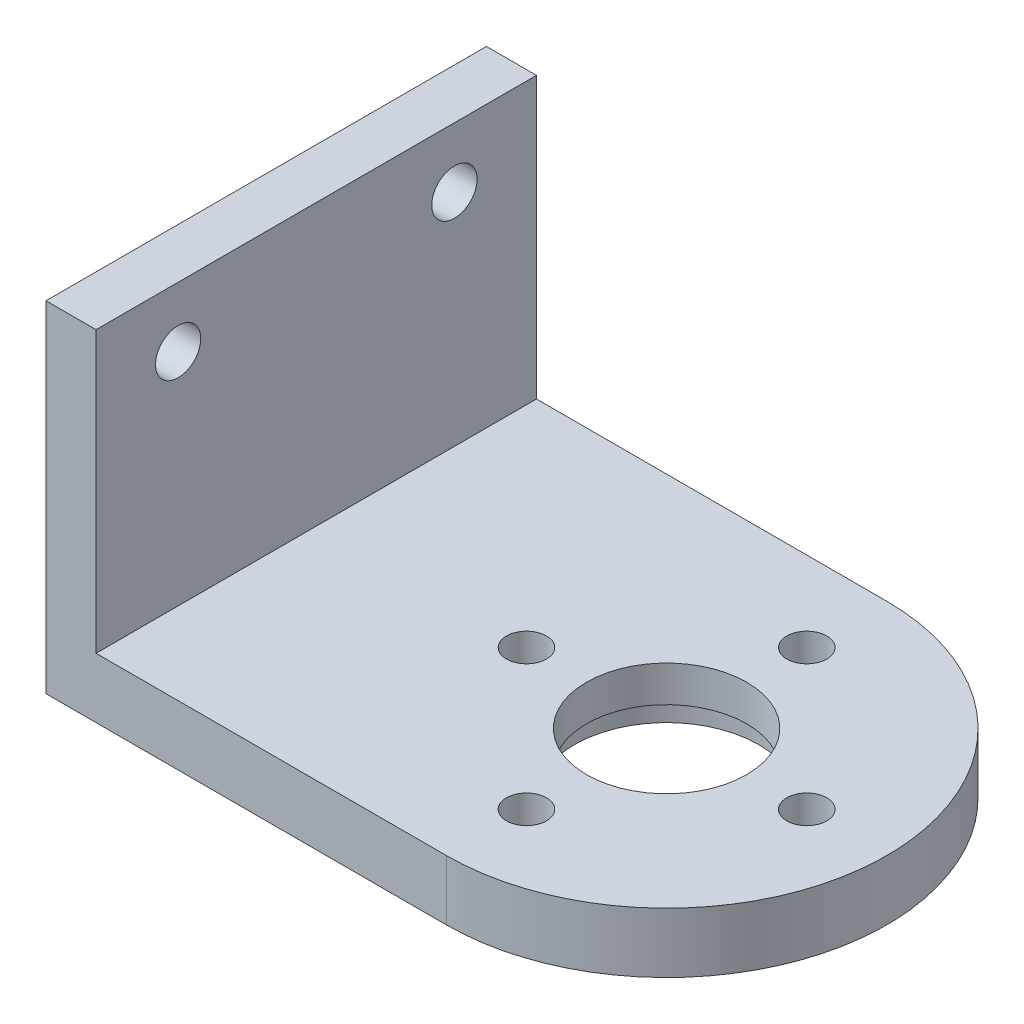
ISO-10303-21;
HEADER;
FILE_DESCRIPTION(('STEP AP214'),'2;1');
FILE_NAME('part.step','',(''),(''),'','','');
FILE_SCHEMA(('AUTOMOTIVE_DESIGN { 1 0 10303 214 1 1 1 1 }'));
ENDSEC;
DATA;
#1=APPLICATION_CONTEXT('core data for automotive mechanical design processes');
#2=APPLICATION_PROTOCOL_DEFINITION('international standard','automotive_design',2000,#1);
#3=PRODUCT_CONTEXT('',#1,'mechanical');
#4=PRODUCT('Part','Part','',(#3));
#5=PRODUCT_RELATED_PRODUCT_CATEGORY('part','',(#4));
#6=PRODUCT_DEFINITION_FORMATION('','',#4);
#7=PRODUCT_DEFINITION_CONTEXT('part definition',#1,'design');
#8=PRODUCT_DEFINITION('design','',#6,#7);
#9=PRODUCT_DEFINITION_SHAPE('','',#8);
#10=(LENGTH_UNIT() NAMED_UNIT(*) SI_UNIT(.MILLI.,.METRE.));
#11=(NAMED_UNIT(*) PLANE_ANGLE_UNIT() SI_UNIT($,.RADIAN.));
#12=(NAMED_UNIT(*) SI_UNIT($,.STERADIAN.) SOLID_ANGLE_UNIT());
#13=UNCERTAINTY_MEASURE_WITH_UNIT(LENGTH_MEASURE(1.E-05),#10,'distance_accuracy_value','');
#14=(GEOMETRIC_REPRESENTATION_CONTEXT(3) GLOBAL_UNCERTAINTY_ASSIGNED_CONTEXT((#13)) GLOBAL_UNIT_ASSIGNED_CONTEXT((#10,
#11,#12)) REPRESENTATION_CONTEXT('',''));
#15=CARTESIAN_POINT('',(0.,0.,0.));
#16=DIRECTION('',(0.,0.,1.));
#17=DIRECTION('',(1.,0.,0.));
#18=AXIS2_PLACEMENT_3D('',#15,#16,#17);
#19=CARTESIAN_POINT('',(5.99999999999998,3.,7.));
#20=DIRECTION('',(0.,-1.,0.));
#21=DIRECTION('',(0.,0.,-1.));
#22=AXIS2_PLACEMENT_3D('',#19,#20,#21);
#23=CYLINDRICAL_SURFACE('',#22,1.);
#24=CARTESIAN_POINT('',(5.99999999999998,3.,7.));
#25=DIRECTION('',(0.,1.,0.));
#26=DIRECTION('',(0.,0.,1.));
#27=AXIS2_PLACEMENT_3D('',#24,#25,#26);
#28=CIRCLE('',#27,1.);
#29=CARTESIAN_POINT('',(5.99999999999998,3.,8.));
#30=VERTEX_POINT('',#29);
#31=EDGE_CURVE('E184',#30,#30,#28,.T.);
#32=ORIENTED_EDGE('',*,*,#31,.T.);
#33=EDGE_LOOP('',(#32));
#34=FACE_BOUND('',#33,.T.);
#35=CARTESIAN_POINT('',(5.99999999999998,1.5,7.));
#36=DIRECTION('',(0.,-1.,0.));
#37=DIRECTION('',(0.,0.,-1.));
#38=AXIS2_PLACEMENT_3D('',#35,#36,#37);
#39=CIRCLE('',#38,1.);
#40=CARTESIAN_POINT('',(5.99999999999998,1.5,6.));
#41=VERTEX_POINT('',#40);
#42=EDGE_CURVE('E39',#41,#41,#39,.T.);
#43=ORIENTED_EDGE('',*,*,#42,.T.);
#44=EDGE_LOOP('',(#43));
#45=FACE_BOUND('',#44,.T.);
#46=ADVANCED_FACE('F35',(#34,#45),#23,.F.);
#47=CARTESIAN_POINT('',(-1.,3.,0.));
#48=DIRECTION('',(0.,-1.,0.));
#49=DIRECTION('',(0.,0.,-1.));
#50=AXIS2_PLACEMENT_3D('',#47,#48,#49);
#51=CYLINDRICAL_SURFACE('',#50,1.);
#52=CARTESIAN_POINT('',(-1.,3.,0.));
#53=DIRECTION('',(0.,1.,0.));
#54=DIRECTION('',(0.,0.,1.));
#55=AXIS2_PLACEMENT_3D('',#52,#53,#54);
#56=CIRCLE('',#55,1.);
#57=CARTESIAN_POINT('',(-1.,3.,0.999999999999951));
#58=VERTEX_POINT('',#57);
#59=EDGE_CURVE('E181',#58,#58,#56,.T.);
#60=ORIENTED_EDGE('',*,*,#59,.T.);
#61=EDGE_LOOP('',(#60));
#62=FACE_BOUND('',#61,.T.);
#63=CARTESIAN_POINT('',(-1.,1.5,0.));
#64=DIRECTION('',(0.,-1.,0.));
#65=DIRECTION('',(0.,0.,-1.));
#66=AXIS2_PLACEMENT_3D('',#63,#64,#65);
#67=CIRCLE('',#66,1.);
#68=CARTESIAN_POINT('',(-1.,1.5,-1.00000000000005));
#69=VERTEX_POINT('',#68);
#70=EDGE_CURVE('E130',#69,#69,#67,.T.);
#71=ORIENTED_EDGE('',*,*,#70,.T.);
#72=EDGE_LOOP('',(#71));
#73=FACE_BOUND('',#72,.T.);
#74=ADVANCED_FACE('F217',(#62,#73),#51,.F.);
#75=CARTESIAN_POINT('',(6.00000000000008,3.,-7.));
#76=DIRECTION('',(0.,-1.,0.));
#77=DIRECTION('',(0.,0.,-1.));
#78=AXIS2_PLACEMENT_3D('',#75,#76,#77);
#79=CYLINDRICAL_SURFACE('',#78,1.);
#80=CARTESIAN_POINT('',(6.00000000000008,3.,-7.));
#81=DIRECTION('',(0.,1.,0.));
#82=DIRECTION('',(0.,0.,1.));
#83=AXIS2_PLACEMENT_3D('',#80,#81,#82);
#84=CIRCLE('',#83,1.);
#85=CARTESIAN_POINT('',(6.00000000000008,3.,-6.));
#86=VERTEX_POINT('',#85);
#87=EDGE_CURVE('E178',#86,#86,#84,.T.);
#88=ORIENTED_EDGE('',*,*,#87,.T.);
#89=EDGE_LOOP('',(#88));
#90=FACE_BOUND('',#89,.T.);
#91=CARTESIAN_POINT('',(6.00000000000008,1.5,-7.));
#92=DIRECTION('',(0.,-1.,0.));
#93=DIRECTION('',(0.,0.,-1.));
#94=AXIS2_PLACEMENT_3D('',#91,#92,#93);
#95=CIRCLE('',#94,1.);
#96=CARTESIAN_POINT('',(6.00000000000008,1.5,-8.));
#97=VERTEX_POINT('',#96);
#98=EDGE_CURVE('E128',#97,#97,#95,.T.);
#99=ORIENTED_EDGE('',*,*,#98,.T.);
#100=EDGE_LOOP('',(#99));
#101=FACE_BOUND('',#100,.T.);
#102=ADVANCED_FACE('F224',(#90,#101),#79,.F.);
#103=CARTESIAN_POINT('',(13.,3.,0.));
#104=DIRECTION('',(0.,-1.,0.));
#105=DIRECTION('',(0.,0.,-1.));
#106=AXIS2_PLACEMENT_3D('',#103,#104,#105);
#107=CYLINDRICAL_SURFACE('',#106,1.);
#108=CARTESIAN_POINT('',(13.,3.,0.));
#109=DIRECTION('',(0.,1.,0.));
#110=DIRECTION('',(0.,0.,1.));
#111=AXIS2_PLACEMENT_3D('',#108,#109,#110);
#112=CIRCLE('',#111,1.);
#113=CARTESIAN_POINT('',(13.,3.,1.));
#114=VERTEX_POINT('',#113);
#115=EDGE_CURVE('E105',#114,#114,#112,.T.);
#116=ORIENTED_EDGE('',*,*,#115,.T.);
#117=EDGE_LOOP('',(#116));
#118=FACE_BOUND('',#117,.T.);
#119=CARTESIAN_POINT('',(13.,1.5,0.));
#120=DIRECTION('',(0.,-1.,0.));
#121=DIRECTION('',(0.,0.,-1.));
#122=AXIS2_PLACEMENT_3D('',#119,#120,#121);
#123=CIRCLE('',#122,1.);
#124=CARTESIAN_POINT('',(13.,1.5,-1.));
#125=VERTEX_POINT('',#124);
#126=EDGE_CURVE('E123',#125,#125,#123,.T.);
#127=ORIENTED_EDGE('',*,*,#126,.T.);
#128=EDGE_LOOP('',(#127));
#129=FACE_BOUND('',#128,.T.);
#130=ADVANCED_FACE('F232',(#118,#129),#107,.F.);
#131=CARTESIAN_POINT('',(6.,3.,0.));
#132=DIRECTION('',(0.,-1.,0.));
#133=DIRECTION('',(0.,0.,-1.));
#134=AXIS2_PLACEMENT_3D('',#131,#132,#133);
#135=CYLINDRICAL_SURFACE('',#134,4.);
#136=CARTESIAN_POINT('',(6.,3.,0.));
#137=DIRECTION('',(0.,1.,0.));
#138=DIRECTION('',(0.,0.,1.));
#139=AXIS2_PLACEMENT_3D('',#136,#137,#138);
#140=CIRCLE('',#139,4.);
#141=CARTESIAN_POINT('',(6.,3.,4.));
#142=VERTEX_POINT('',#141);
#143=EDGE_CURVE('E109',#142,#142,#140,.T.);
#144=ORIENTED_EDGE('',*,*,#143,.T.);
#145=EDGE_LOOP('',(#144));
#146=FACE_BOUND('',#145,.T.);
#147=CARTESIAN_POINT('',(6.,1.2,0.));
#148=DIRECTION('',(0.,-1.,0.));
#149=DIRECTION('',(0.,0.,-1.));
#150=AXIS2_PLACEMENT_3D('',#147,#148,#149);
#151=CIRCLE('',#150,4.);
#152=CARTESIAN_POINT('',(6.,1.2,-4.));
#153=VERTEX_POINT('',#152);
#154=EDGE_CURVE('E118',#153,#153,#151,.T.);
#155=ORIENTED_EDGE('',*,*,#154,.T.);
#156=EDGE_LOOP('',(#155));
#157=FACE_BOUND('',#156,.T.);
#158=ADVANCED_FACE('F229',(#146,#157),#135,.F.);
#159=CARTESIAN_POINT('',(6.,3.,0.));
#160=DIRECTION('',(0.,1.,0.));
#161=DIRECTION('',(0.,0.,1.));
#162=AXIS2_PLACEMENT_3D('',#159,#160,#161);
#163=PLANE('',#162);
#164=DIRECTION('',(0.,0.,-1.));
#165=VECTOR('',#164,1.);
#166=CARTESIAN_POINT('',(-11.5,3.,-11.));
#167=LINE('',#166,#165);
#168=CARTESIAN_POINT('',(-11.5,3.,11.));
#169=VERTEX_POINT('',#168);
#170=CARTESIAN_POINT('',(-11.5,3.,-11.));
#171=VERTEX_POINT('',#170);
#172=EDGE_CURVE('E52',#169,#171,#167,.T.);
#173=ORIENTED_EDGE('',*,*,#172,.F.);
#174=DIRECTION('',(1.,0.,0.));
#175=VECTOR('',#174,1.);
#176=CARTESIAN_POINT('',(6.,3.,11.));
#177=LINE('',#176,#175);
#178=CARTESIAN_POINT('',(6.,3.,11.));
#179=VERTEX_POINT('',#178);
#180=EDGE_CURVE('E90',#169,#179,#177,.T.);
#181=ORIENTED_EDGE('',*,*,#180,.T.);
#182=CARTESIAN_POINT('',(6.,3.,0.));
#183=DIRECTION('',(0.,1.,0.));
#184=DIRECTION('',(0.,0.,1.));
#185=AXIS2_PLACEMENT_3D('',#182,#183,#184);
#186=CIRCLE('',#185,11.);
#187=CARTESIAN_POINT('',(6.,3.,-11.));
#188=VERTEX_POINT('',#187);
#189=EDGE_CURVE('E58',#179,#188,#186,.T.);
#190=ORIENTED_EDGE('',*,*,#189,.T.);
#191=DIRECTION('',(-1.,0.,0.));
#192=VECTOR('',#191,1.);
#193=CARTESIAN_POINT('',(-14.,3.,-11.));
#194=LINE('',#193,#192);
#195=EDGE_CURVE('E101',#188,#171,#194,.T.);
#196=ORIENTED_EDGE('',*,*,#195,.T.);
#197=EDGE_LOOP('',(#173,#181,#190,#196));
#198=FACE_BOUND('',#197,.T.);
#199=ORIENTED_EDGE('',*,*,#59,.F.);
#200=EDGE_LOOP('',(#199));
#201=FACE_BOUND('',#200,.T.);
#202=ORIENTED_EDGE('',*,*,#143,.F.);
#203=EDGE_LOOP('',(#202));
#204=FACE_BOUND('',#203,.T.);
#205=ORIENTED_EDGE('',*,*,#115,.F.);
#206=EDGE_LOOP('',(#205));
#207=FACE_BOUND('',#206,.T.);
#208=ORIENTED_EDGE('',*,*,#31,.F.);
#209=EDGE_LOOP('',(#208));
#210=FACE_BOUND('',#209,.T.);
#211=ORIENTED_EDGE('',*,*,#87,.F.);
#212=EDGE_LOOP('',(#211));
#213=FACE_BOUND('',#212,.T.);
#214=ADVANCED_FACE('F191',(#198,#201,#204,#207,#210,#213),#163,.T.);
#215=CARTESIAN_POINT('',(6.,0.,0.));
#216=DIRECTION('',(0.,1.,0.));
#217=DIRECTION('',(0.,0.,1.));
#218=AXIS2_PLACEMENT_3D('',#215,#216,#217);
#219=PLANE('',#218);
#220=CARTESIAN_POINT('',(5.99999999999415,0.,-6.99999999999538));
#221=DIRECTION('',(0.,-1.,0.));
#222=DIRECTION('',(0.,0.,-1.));
#223=AXIS2_PLACEMENT_3D('',#220,#221,#222);
#224=CIRCLE('',#223,1.9);
#225=CARTESIAN_POINT('',(5.99999999999415,0.,-8.89999999999538));
#226=VERTEX_POINT('',#225);
#227=EDGE_CURVE('E284',#226,#226,#224,.T.);
#228=ORIENTED_EDGE('',*,*,#227,.F.);
#229=EDGE_LOOP('',(#228));
#230=FACE_BOUND('',#229,.T.);
#231=CARTESIAN_POINT('',(-1.00000000000121,0.,1.04930458969917E-11));
#232=DIRECTION('',(0.,-1.,0.));
#233=DIRECTION('',(0.,0.,-1.));
#234=AXIS2_PLACEMENT_3D('',#231,#232,#233);
#235=CIRCLE('',#234,1.9);
#236=CARTESIAN_POINT('',(-1.00000000000121,0.,-1.89999999998951));
#237=VERTEX_POINT('',#236);
#238=EDGE_CURVE('E292',#237,#237,#235,.T.);
#239=ORIENTED_EDGE('',*,*,#238,.F.);
#240=EDGE_LOOP('',(#239));
#241=FACE_BOUND('',#240,.T.);
#242=CARTESIAN_POINT('',(6.00000000000469,0.,7.00000000000583));
#243=DIRECTION('',(0.,-1.,0.));
#244=DIRECTION('',(0.,0.,-1.));
#245=AXIS2_PLACEMENT_3D('',#242,#243,#244);
#246=CIRCLE('',#245,1.9);
#247=CARTESIAN_POINT('',(6.00000000000469,0.,5.10000000000583));
#248=VERTEX_POINT('',#247);
#249=EDGE_CURVE('E297',#248,#248,#246,.T.);
#250=ORIENTED_EDGE('',*,*,#249,.F.);
#251=EDGE_LOOP('',(#250));
#252=FACE_BOUND('',#251,.T.);
#253=CARTESIAN_POINT('',(13.,0.,0.));
#254=DIRECTION('',(0.,-1.,0.));
#255=DIRECTION('',(0.,0.,-1.));
#256=AXIS2_PLACEMENT_3D('',#253,#254,#255);
#257=CIRCLE('',#256,1.9);
#258=CARTESIAN_POINT('',(13.,0.,-1.9));
#259=VERTEX_POINT('',#258);
#260=EDGE_CURVE('E136',#259,#259,#257,.T.);
#261=ORIENTED_EDGE('',*,*,#260,.F.);
#262=EDGE_LOOP('',(#261));
#263=FACE_BOUND('',#262,.T.);
#264=CARTESIAN_POINT('',(5.99999999999939,0.,5.22208257912396E-12));
#265=DIRECTION('',(0.,-1.,0.));
#266=DIRECTION('',(0.,0.,-1.));
#267=AXIS2_PLACEMENT_3D('',#264,#265,#266);
#268=CIRCLE('',#267,4.60000000001315);
#269=CARTESIAN_POINT('',(5.99999999999939,0.,-4.60000000000793));
#270=VERTEX_POINT('',#269);
#271=EDGE_CURVE('E126',#270,#270,#268,.T.);
#272=ORIENTED_EDGE('',*,*,#271,.F.);
#273=EDGE_LOOP('',(#272));
#274=FACE_BOUND('',#273,.T.);
#275=DIRECTION('',(1.,0.,0.));
#276=VECTOR('',#275,1.);
#277=CARTESIAN_POINT('',(6.,0.,11.));
#278=LINE('',#277,#276);
#279=CARTESIAN_POINT('',(-14.,0.,11.));
#280=VERTEX_POINT('',#279);
#281=CARTESIAN_POINT('',(6.,0.,11.));
#282=VERTEX_POINT('',#281);
#283=EDGE_CURVE('E96',#280,#282,#278,.T.);
#284=ORIENTED_EDGE('',*,*,#283,.F.);
#285=DIRECTION('',(0.,0.,1.));
#286=VECTOR('',#285,1.);
#287=CARTESIAN_POINT('',(-14.,0.,11.));
#288=LINE('',#287,#286);
#289=CARTESIAN_POINT('',(-14.,0.,-11.));
#290=VERTEX_POINT('',#289);
#291=EDGE_CURVE('E78',#290,#280,#288,.T.);
#292=ORIENTED_EDGE('',*,*,#291,.F.);
#293=DIRECTION('',(-1.,0.,0.));
#294=VECTOR('',#293,1.);
#295=CARTESIAN_POINT('',(-14.,0.,-11.));
#296=LINE('',#295,#294);
#297=CARTESIAN_POINT('',(6.,0.,-11.));
#298=VERTEX_POINT('',#297);
#299=EDGE_CURVE('E91',#298,#290,#296,.T.);
#300=ORIENTED_EDGE('',*,*,#299,.F.);
#301=CARTESIAN_POINT('',(6.,0.,0.));
#302=DIRECTION('',(0.,1.,0.));
#303=DIRECTION('',(0.,0.,1.));
#304=AXIS2_PLACEMENT_3D('',#301,#302,#303);
#305=CIRCLE('',#304,11.);
#306=EDGE_CURVE('E104',#282,#298,#305,.T.);
#307=ORIENTED_EDGE('',*,*,#306,.F.);
#308=EDGE_LOOP('',(#284,#292,#300,#307));
#309=FACE_BOUND('',#308,.T.);
#310=ADVANCED_FACE('F103',(#230,#241,#252,#263,#274,#309),#219,.F.);
#311=CARTESIAN_POINT('',(6.,3.,11.));
#312=DIRECTION('',(0.,0.,-1.));
#313=DIRECTION('',(-1.,0.,0.));
#314=AXIS2_PLACEMENT_3D('',#311,#312,#313);
#315=PLANE('',#314);
#316=ORIENTED_EDGE('',*,*,#283,.T.);
#317=DIRECTION('',(0.,-1.,0.));
#318=VECTOR('',#317,1.);
#319=CARTESIAN_POINT('',(6.,3.,11.));
#320=LINE('',#319,#318);
#321=EDGE_CURVE('E11',#179,#282,#320,.T.);
#322=ORIENTED_EDGE('',*,*,#321,.F.);
#323=ORIENTED_EDGE('',*,*,#180,.F.);
#324=DIRECTION('',(0.,-1.,0.));
#325=VECTOR('',#324,1.);
#326=CARTESIAN_POINT('',(-11.5,17.,11.));
#327=LINE('',#326,#325);
#328=CARTESIAN_POINT('',(-11.5,17.,11.));
#329=VERTEX_POINT('',#328);
#330=EDGE_CURVE('E175',#329,#169,#327,.T.);
#331=ORIENTED_EDGE('',*,*,#330,.F.);
#332=DIRECTION('',(1.,0.,0.));
#333=VECTOR('',#332,1.);
#334=CARTESIAN_POINT('',(-11.5,17.,11.));
#335=LINE('',#334,#333);
#336=CARTESIAN_POINT('',(-14.,17.,11.));
#337=VERTEX_POINT('',#336);
#338=EDGE_CURVE('E99',#337,#329,#335,.T.);
#339=ORIENTED_EDGE('',*,*,#338,.F.);
#340=DIRECTION('',(0.,-1.,0.));
#341=VECTOR('',#340,1.);
#342=CARTESIAN_POINT('',(-14.,3.,11.));
#343=LINE('',#342,#341);
#344=EDGE_CURVE('E83',#337,#280,#343,.T.);
#345=ORIENTED_EDGE('',*,*,#344,.T.);
#346=EDGE_LOOP('',(#316,#322,#323,#331,#339,#345));
#347=FACE_BOUND('',#346,.T.);
#348=ADVANCED_FACE('F37',(#347),#315,.F.);
#349=CARTESIAN_POINT('',(6.,3.,0.));
#350=DIRECTION('',(0.,-1.,0.));
#351=DIRECTION('',(0.,0.,-1.));
#352=AXIS2_PLACEMENT_3D('',#349,#350,#351);
#353=CYLINDRICAL_SURFACE('',#352,11.);
#354=ORIENTED_EDGE('',*,*,#306,.T.);
#355=DIRECTION('',(0.,-1.,0.));
#356=VECTOR('',#355,1.);
#357=CARTESIAN_POINT('',(6.,3.,-11.));
#358=LINE('',#357,#356);
#359=EDGE_CURVE('E44',#188,#298,#358,.T.);
#360=ORIENTED_EDGE('',*,*,#359,.F.);
#361=ORIENTED_EDGE('',*,*,#189,.F.);
#362=ORIENTED_EDGE('',*,*,#321,.T.);
#363=EDGE_LOOP('',(#354,#360,#361,#362));
#364=FACE_BOUND('',#363,.T.);
#365=ADVANCED_FACE('F209',(#364),#353,.T.);
#366=CARTESIAN_POINT('',(-14.,3.,-11.));
#367=DIRECTION('',(0.,0.,1.));
#368=DIRECTION('',(1.,0.,0.));
#369=AXIS2_PLACEMENT_3D('',#366,#367,#368);
#370=PLANE('',#369);
#371=ORIENTED_EDGE('',*,*,#299,.T.);
#372=DIRECTION('',(0.,-1.,0.));
#373=VECTOR('',#372,1.);
#374=CARTESIAN_POINT('',(-14.,3.,-11.));
#375=LINE('',#374,#373);
#376=CARTESIAN_POINT('',(-14.,17.,-11.));
#377=VERTEX_POINT('',#376);
#378=EDGE_CURVE('E86',#377,#290,#375,.T.);
#379=ORIENTED_EDGE('',*,*,#378,.F.);
#380=DIRECTION('',(-1.,0.,0.));
#381=VECTOR('',#380,1.);
#382=CARTESIAN_POINT('',(-14.,17.,-11.));
#383=LINE('',#382,#381);
#384=CARTESIAN_POINT('',(-11.5,17.,-11.));
#385=VERTEX_POINT('',#384);
#386=EDGE_CURVE('E168',#385,#377,#383,.T.);
#387=ORIENTED_EDGE('',*,*,#386,.F.);
#388=DIRECTION('',(0.,-1.,0.));
#389=VECTOR('',#388,1.);
#390=CARTESIAN_POINT('',(-11.5,17.,-11.));
#391=LINE('',#390,#389);
#392=EDGE_CURVE('E171',#385,#171,#391,.T.);
#393=ORIENTED_EDGE('',*,*,#392,.T.);
#394=ORIENTED_EDGE('',*,*,#195,.F.);
#395=ORIENTED_EDGE('',*,*,#359,.T.);
#396=EDGE_LOOP('',(#371,#379,#387,#393,#394,#395));
#397=FACE_BOUND('',#396,.T.);
#398=ADVANCED_FACE('F200',(#397),#370,.F.);
#399=CARTESIAN_POINT('',(-14.,3.,11.));
#400=DIRECTION('',(1.,0.,0.));
#401=DIRECTION('',(0.,0.,-1.));
#402=AXIS2_PLACEMENT_3D('',#399,#400,#401);
#403=PLANE('',#402);
#404=CARTESIAN_POINT('',(-14.,14.,6.9));
#405=DIRECTION('',(1.,0.,0.));
#406=DIRECTION('',(0.,0.,-1.));
#407=AXIS2_PLACEMENT_3D('',#404,#405,#406);
#408=CIRCLE('',#407,1.13097743795664);
#409=CARTESIAN_POINT('',(-14.,14.,5.76902256204336));
#410=VERTEX_POINT('',#409);
#411=EDGE_CURVE('E153',#410,#410,#408,.T.);
#412=ORIENTED_EDGE('',*,*,#411,.T.);
#413=EDGE_LOOP('',(#412));
#414=FACE_BOUND('',#413,.T.);
#415=CARTESIAN_POINT('',(-14.,14.,-6.9));
#416=DIRECTION('',(1.,0.,0.));
#417=DIRECTION('',(0.,0.,-1.));
#418=AXIS2_PLACEMENT_3D('',#415,#416,#417);
#419=CIRCLE('',#418,1.1323934249751);
#420=CARTESIAN_POINT('',(-14.,14.,-8.0323934249751));
#421=VERTEX_POINT('',#420);
#422=EDGE_CURVE('E159',#421,#421,#419,.T.);
#423=ORIENTED_EDGE('',*,*,#422,.T.);
#424=EDGE_LOOP('',(#423));
#425=FACE_BOUND('',#424,.T.);
#426=ORIENTED_EDGE('',*,*,#291,.T.);
#427=ORIENTED_EDGE('',*,*,#344,.F.);
#428=DIRECTION('',(0.,0.,1.));
#429=VECTOR('',#428,1.);
#430=CARTESIAN_POINT('',(-14.,17.,-11.));
#431=LINE('',#430,#429);
#432=EDGE_CURVE('E162',#377,#337,#431,.T.);
#433=ORIENTED_EDGE('',*,*,#432,.F.);
#434=ORIENTED_EDGE('',*,*,#378,.T.);
#435=EDGE_LOOP('',(#426,#427,#433,#434));
#436=FACE_BOUND('',#435,.T.);
#437=ADVANCED_FACE('F80',(#414,#425,#436),#403,.F.);
#438=CARTESIAN_POINT('',(-11.5,17.,-11.));
#439=DIRECTION('',(-1.,0.,0.));
#440=DIRECTION('',(0.,0.,1.));
#441=AXIS2_PLACEMENT_3D('',#438,#439,#440);
#442=PLANE('',#441);
#443=CARTESIAN_POINT('',(-11.5,14.,6.9));
#444=DIRECTION('',(1.,0.,0.));
#445=DIRECTION('',(0.,0.,-1.));
#446=AXIS2_PLACEMENT_3D('',#443,#444,#445);
#447=CIRCLE('',#446,1.13097743795664);
#448=CARTESIAN_POINT('',(-11.5,14.,5.76902256204336));
#449=VERTEX_POINT('',#448);
#450=EDGE_CURVE('E121',#449,#449,#447,.T.);
#451=ORIENTED_EDGE('',*,*,#450,.F.);
#452=EDGE_LOOP('',(#451));
#453=FACE_BOUND('',#452,.T.);
#454=CARTESIAN_POINT('',(-11.5,14.,-6.9));
#455=DIRECTION('',(1.,0.,0.));
#456=DIRECTION('',(0.,0.,-1.));
#457=AXIS2_PLACEMENT_3D('',#454,#455,#456);
#458=CIRCLE('',#457,1.1323934249751);
#459=CARTESIAN_POINT('',(-11.5,14.,-8.0323934249751));
#460=VERTEX_POINT('',#459);
#461=EDGE_CURVE('E156',#460,#460,#458,.T.);
#462=ORIENTED_EDGE('',*,*,#461,.F.);
#463=EDGE_LOOP('',(#462));
#464=FACE_BOUND('',#463,.T.);
#465=ORIENTED_EDGE('',*,*,#172,.T.);
#466=ORIENTED_EDGE('',*,*,#392,.F.);
#467=DIRECTION('',(0.,0.,-1.));
#468=VECTOR('',#467,1.);
#469=CARTESIAN_POINT('',(-11.5,17.,-11.));
#470=LINE('',#469,#468);
#471=EDGE_CURVE('E165',#329,#385,#470,.T.);
#472=ORIENTED_EDGE('',*,*,#471,.F.);
#473=ORIENTED_EDGE('',*,*,#330,.T.);
#474=EDGE_LOOP('',(#465,#466,#472,#473));
#475=FACE_BOUND('',#474,.T.);
#476=ADVANCED_FACE('F196',(#453,#464,#475),#442,.F.);
#477=CARTESIAN_POINT('',(0.,17.,0.));
#478=DIRECTION('',(0.,-1.,0.));
#479=DIRECTION('',(0.,0.,-1.));
#480=AXIS2_PLACEMENT_3D('',#477,#478,#479);
#481=PLANE('',#480);
#482=ORIENTED_EDGE('',*,*,#432,.T.);
#483=ORIENTED_EDGE('',*,*,#338,.T.);
#484=ORIENTED_EDGE('',*,*,#471,.T.);
#485=ORIENTED_EDGE('',*,*,#386,.T.);
#486=EDGE_LOOP('',(#482,#483,#484,#485));
#487=FACE_BOUND('',#486,.T.);
#488=ADVANCED_FACE('F204',(#487),#481,.F.);
#489=CARTESIAN_POINT('',(-17.5,14.,-6.9));
#490=DIRECTION('',(1.,0.,0.));
#491=DIRECTION('',(0.,0.,-1.));
#492=AXIS2_PLACEMENT_3D('',#489,#490,#491);
#493=CYLINDRICAL_SURFACE('',#492,1.1323934249751);
#494=ORIENTED_EDGE('',*,*,#461,.T.);
#495=EDGE_LOOP('',(#494));
#496=FACE_BOUND('',#495,.T.);
#497=ORIENTED_EDGE('',*,*,#422,.F.);
#498=EDGE_LOOP('',(#497));
#499=FACE_BOUND('',#498,.T.);
#500=ADVANCED_FACE('F253',(#496,#499),#493,.F.);
#501=CARTESIAN_POINT('',(-17.5,14.,6.9));
#502=DIRECTION('',(1.,0.,0.));
#503=DIRECTION('',(0.,0.,-1.));
#504=AXIS2_PLACEMENT_3D('',#501,#502,#503);
#505=CYLINDRICAL_SURFACE('',#504,1.13097743795664);
#506=ORIENTED_EDGE('',*,*,#450,.T.);
#507=EDGE_LOOP('',(#506));
#508=FACE_BOUND('',#507,.T.);
#509=ORIENTED_EDGE('',*,*,#411,.F.);
#510=EDGE_LOOP('',(#509));
#511=FACE_BOUND('',#510,.T.);
#512=ADVANCED_FACE('F255',(#508,#511),#505,.F.);
#513=CARTESIAN_POINT('',(5.99999999999939,1.2,5.22208257912396E-12));
#514=DIRECTION('',(0.,-1.,0.));
#515=DIRECTION('',(0.,0.,-1.));
#516=AXIS2_PLACEMENT_3D('',#513,#514,#515);
#517=CYLINDRICAL_SURFACE('',#516,4.60000000001315);
#518=CARTESIAN_POINT('',(5.99999999999939,1.2,5.22208257912396E-12));
#519=DIRECTION('',(0.,-1.,0.));
#520=DIRECTION('',(0.,0.,-1.));
#521=AXIS2_PLACEMENT_3D('',#518,#519,#520);
#522=CIRCLE('',#521,4.60000000001315);
#523=CARTESIAN_POINT('',(5.99999999999939,1.2,-4.60000000000793));
#524=VERTEX_POINT('',#523);
#525=EDGE_CURVE('E122',#524,#524,#522,.T.);
#526=ORIENTED_EDGE('',*,*,#525,.F.);
#527=EDGE_LOOP('',(#526));
#528=FACE_BOUND('',#527,.T.);
#529=ORIENTED_EDGE('',*,*,#271,.T.);
#530=EDGE_LOOP('',(#529));
#531=FACE_BOUND('',#530,.T.);
#532=ADVANCED_FACE('F262',(#528,#531),#517,.F.);
#533=CARTESIAN_POINT('',(5.99999999999939,1.2,5.22208257912396E-12));
#534=DIRECTION('',(0.,-1.,0.));
#535=DIRECTION('',(0.,0.,-1.));
#536=AXIS2_PLACEMENT_3D('',#533,#534,#535);
#537=PLANE('',#536);
#538=ORIENTED_EDGE('',*,*,#154,.F.);
#539=EDGE_LOOP('',(#538));
#540=FACE_BOUND('',#539,.T.);
#541=ORIENTED_EDGE('',*,*,#525,.T.);
#542=EDGE_LOOP('',(#541));
#543=FACE_BOUND('',#542,.T.);
#544=ADVANCED_FACE('F308',(#540,#543),#537,.T.);
#545=CARTESIAN_POINT('',(13.,1.5,0.));
#546=DIRECTION('',(0.,-1.,0.));
#547=DIRECTION('',(0.,0.,-1.));
#548=AXIS2_PLACEMENT_3D('',#545,#546,#547);
#549=CYLINDRICAL_SURFACE('',#548,1.9);
#550=CARTESIAN_POINT('',(13.,1.5,0.));
#551=DIRECTION('',(0.,-1.,0.));
#552=DIRECTION('',(0.,0.,-1.));
#553=AXIS2_PLACEMENT_3D('',#550,#551,#552);
#554=CIRCLE('',#553,1.9);
#555=CARTESIAN_POINT('',(13.,1.5,-1.9));
#556=VERTEX_POINT('',#555);
#557=EDGE_CURVE('E127',#556,#556,#554,.T.);
#558=ORIENTED_EDGE('',*,*,#557,.F.);
#559=EDGE_LOOP('',(#558));
#560=FACE_BOUND('',#559,.T.);
#561=ORIENTED_EDGE('',*,*,#260,.T.);
#562=EDGE_LOOP('',(#561));
#563=FACE_BOUND('',#562,.T.);
#564=ADVANCED_FACE('F314',(#560,#563),#549,.F.);
#565=CARTESIAN_POINT('',(13.,1.5,0.));
#566=DIRECTION('',(0.,-1.,0.));
#567=DIRECTION('',(0.,0.,-1.));
#568=AXIS2_PLACEMENT_3D('',#565,#566,#567);
#569=PLANE('',#568);
#570=ORIENTED_EDGE('',*,*,#126,.F.);
#571=EDGE_LOOP('',(#570));
#572=FACE_BOUND('',#571,.T.);
#573=ORIENTED_EDGE('',*,*,#557,.T.);
#574=EDGE_LOOP('',(#573));
#575=FACE_BOUND('',#574,.T.);
#576=ADVANCED_FACE('F321',(#572,#575),#569,.T.);
#577=CARTESIAN_POINT('',(5.99999999999415,1.5,-6.99999999999538));
#578=DIRECTION('',(0.,-1.,0.));
#579=DIRECTION('',(0.,0.,-1.));
#580=AXIS2_PLACEMENT_3D('',#577,#578,#579);
#581=CYLINDRICAL_SURFACE('',#580,1.9);
#582=CARTESIAN_POINT('',(5.99999999999415,1.5,-6.99999999999538));
#583=DIRECTION('',(0.,-1.,0.));
#584=DIRECTION('',(0.,0.,-1.));
#585=AXIS2_PLACEMENT_3D('',#582,#583,#584);
#586=CIRCLE('',#585,1.9);
#587=CARTESIAN_POINT('',(5.99999999999415,1.5,-8.89999999999538));
#588=VERTEX_POINT('',#587);
#589=EDGE_CURVE('E131',#588,#588,#586,.T.);
#590=ORIENTED_EDGE('',*,*,#589,.F.);
#591=EDGE_LOOP('',(#590));
#592=FACE_BOUND('',#591,.T.);
#593=ORIENTED_EDGE('',*,*,#227,.T.);
#594=EDGE_LOOP('',(#593));
#595=FACE_BOUND('',#594,.T.);
#596=ADVANCED_FACE('F279',(#592,#595),#581,.F.);
#597=CARTESIAN_POINT('',(5.99999999999415,1.5,-6.99999999999538));
#598=DIRECTION('',(0.,-1.,0.));
#599=DIRECTION('',(0.,0.,-1.));
#600=AXIS2_PLACEMENT_3D('',#597,#598,#599);
#601=PLANE('',#600);
#602=ORIENTED_EDGE('',*,*,#98,.F.);
#603=EDGE_LOOP('',(#602));
#604=FACE_BOUND('',#603,.T.);
#605=ORIENTED_EDGE('',*,*,#589,.T.);
#606=EDGE_LOOP('',(#605));
#607=FACE_BOUND('',#606,.T.);
#608=ADVANCED_FACE('F275',(#604,#607),#601,.T.);
#609=CARTESIAN_POINT('',(-1.00000000000121,1.5,1.04930458969917E-11));
#610=DIRECTION('',(0.,-1.,0.));
#611=DIRECTION('',(0.,0.,-1.));
#612=AXIS2_PLACEMENT_3D('',#609,#610,#611);
#613=CYLINDRICAL_SURFACE('',#612,1.9);
#614=CARTESIAN_POINT('',(-1.00000000000121,1.5,1.04930458969917E-11));
#615=DIRECTION('',(0.,-1.,0.));
#616=DIRECTION('',(0.,0.,-1.));
#617=AXIS2_PLACEMENT_3D('',#614,#615,#616);
#618=CIRCLE('',#617,1.9);
#619=CARTESIAN_POINT('',(-1.00000000000121,1.5,-1.89999999998951));
#620=VERTEX_POINT('',#619);
#621=EDGE_CURVE('E287',#620,#620,#618,.T.);
#622=ORIENTED_EDGE('',*,*,#621,.F.);
#623=EDGE_LOOP('',(#622));
#624=FACE_BOUND('',#623,.T.);
#625=ORIENTED_EDGE('',*,*,#238,.T.);
#626=EDGE_LOOP('',(#625));
#627=FACE_BOUND('',#626,.T.);
#628=ADVANCED_FACE('F278',(#624,#627),#613,.F.);
#629=CARTESIAN_POINT('',(-1.00000000000121,1.5,1.04930458969917E-11));
#630=DIRECTION('',(0.,-1.,0.));
#631=DIRECTION('',(0.,0.,-1.));
#632=AXIS2_PLACEMENT_3D('',#629,#630,#631);
#633=PLANE('',#632);
#634=ORIENTED_EDGE('',*,*,#70,.F.);
#635=EDGE_LOOP('',(#634));
#636=FACE_BOUND('',#635,.T.);
#637=ORIENTED_EDGE('',*,*,#621,.T.);
#638=EDGE_LOOP('',(#637));
#639=FACE_BOUND('',#638,.T.);
#640=ADVANCED_FACE('F329',(#636,#639),#633,.T.);
#641=CARTESIAN_POINT('',(6.00000000000469,1.5,7.00000000000583));
#642=DIRECTION('',(0.,-1.,0.));
#643=DIRECTION('',(0.,0.,-1.));
#644=AXIS2_PLACEMENT_3D('',#641,#642,#643);
#645=CYLINDRICAL_SURFACE('',#644,1.9);
#646=CARTESIAN_POINT('',(6.00000000000469,1.5,7.00000000000583));
#647=DIRECTION('',(0.,-1.,0.));
#648=DIRECTION('',(0.,0.,-1.));
#649=AXIS2_PLACEMENT_3D('',#646,#647,#648);
#650=CIRCLE('',#649,1.9);
#651=CARTESIAN_POINT('',(6.00000000000469,1.5,5.10000000000583));
#652=VERTEX_POINT('',#651);
#653=EDGE_CURVE('E295',#652,#652,#650,.T.);
#654=ORIENTED_EDGE('',*,*,#653,.F.);
#655=EDGE_LOOP('',(#654));
#656=FACE_BOUND('',#655,.T.);
#657=ORIENTED_EDGE('',*,*,#249,.T.);
#658=EDGE_LOOP('',(#657));
#659=FACE_BOUND('',#658,.T.);
#660=ADVANCED_FACE('F301',(#656,#659),#645,.F.);
#661=CARTESIAN_POINT('',(6.00000000000469,1.5,7.00000000000583));
#662=DIRECTION('',(0.,-1.,0.));
#663=DIRECTION('',(0.,0.,-1.));
#664=AXIS2_PLACEMENT_3D('',#661,#662,#663);
#665=PLANE('',#664);
#666=ORIENTED_EDGE('',*,*,#42,.F.);
#667=EDGE_LOOP('',(#666));
#668=FACE_BOUND('',#667,.T.);
#669=ORIENTED_EDGE('',*,*,#653,.T.);
#670=EDGE_LOOP('',(#669));
#671=FACE_BOUND('',#670,.T.);
#672=ADVANCED_FACE('F328',(#668,#671),#665,.T.);
#673=CLOSED_SHELL('',(#46,#74,#102,#130,#158,#214,#310,#348,#365,#398,#437,#476,#488,#500,#512,
#532,#544,#564,#576,#596,#608,#628,#640,#660,#672));
#674=MANIFOLD_SOLID_BREP('B2',#673);
#675=ADVANCED_BREP_SHAPE_REPRESENTATION('',(#18,#674),#14);
#676=SHAPE_DEFINITION_REPRESENTATION(#9,#675);
ENDSEC;
END-ISO-10303-21;
